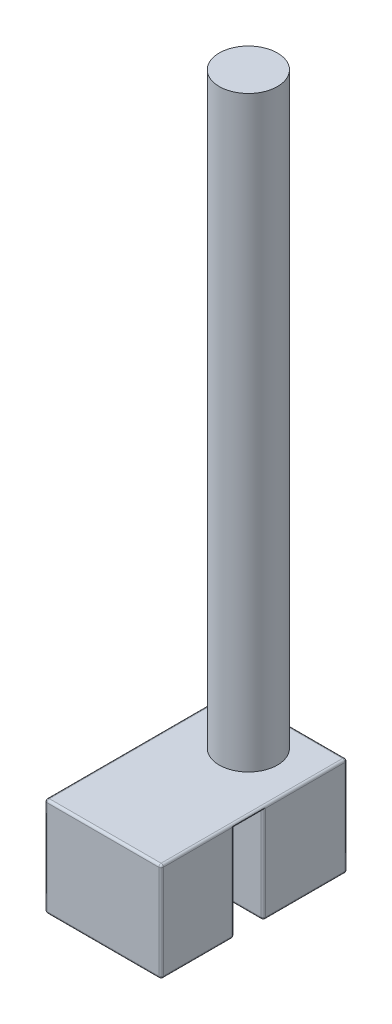
ISO-10303-21;
HEADER;
FILE_DESCRIPTION(('STEP AP214'),'2;1');
FILE_NAME('part.step','',(''),(''),'','','');
FILE_SCHEMA(('AUTOMOTIVE_DESIGN { 1 0 10303 214 1 1 1 1 }'));
ENDSEC;
DATA;
#1=APPLICATION_CONTEXT('core data for automotive mechanical design processes');
#2=APPLICATION_PROTOCOL_DEFINITION('international standard','automotive_design',2000,#1);
#3=PRODUCT_CONTEXT('',#1,'mechanical');
#4=PRODUCT('Part','Part','',(#3));
#5=PRODUCT_RELATED_PRODUCT_CATEGORY('part','',(#4));
#6=PRODUCT_DEFINITION_FORMATION('','',#4);
#7=PRODUCT_DEFINITION_CONTEXT('part definition',#1,'design');
#8=PRODUCT_DEFINITION('design','',#6,#7);
#9=PRODUCT_DEFINITION_SHAPE('','',#8);
#10=(LENGTH_UNIT() NAMED_UNIT(*) SI_UNIT(.MILLI.,.METRE.));
#11=(NAMED_UNIT(*) PLANE_ANGLE_UNIT() SI_UNIT($,.RADIAN.));
#12=(NAMED_UNIT(*) SI_UNIT($,.STERADIAN.) SOLID_ANGLE_UNIT());
#13=UNCERTAINTY_MEASURE_WITH_UNIT(LENGTH_MEASURE(1.E-05),#10,'distance_accuracy_value','');
#14=(GEOMETRIC_REPRESENTATION_CONTEXT(3) GLOBAL_UNCERTAINTY_ASSIGNED_CONTEXT((#13)) GLOBAL_UNIT_ASSIGNED_CONTEXT((#10,
#11,#12)) REPRESENTATION_CONTEXT('',''));
#15=CARTESIAN_POINT('',(0.,0.,0.));
#16=DIRECTION('',(0.,0.,1.));
#17=DIRECTION('',(1.,0.,0.));
#18=AXIS2_PLACEMENT_3D('',#15,#16,#17);
#19=CARTESIAN_POINT('',(39.990340286254,85.,-18.5580204778157));
#20=DIRECTION('',(-1.,0.,0.));
#21=DIRECTION('',(0.,0.,1.));
#22=AXIS2_PLACEMENT_3D('',#19,#20,#21);
#23=PLANE('',#22);
#24=DIRECTION('',(0.,1.,0.));
#25=VECTOR('',#24,1.);
#26=CARTESIAN_POINT('',(39.990340286254,85.,51.6780797430993));
#27=LINE('',#26,#25);
#28=CARTESIAN_POINT('',(39.990340286254,83.,51.6780797430993));
#29=VERTEX_POINT('',#28);
#30=CARTESIAN_POINT('',(39.990340286254,2.,51.6780797430993));
#31=VERTEX_POINT('',#30);
#32=EDGE_CURVE('E227',#29,#31,#27,.F.);
#33=ORIENTED_EDGE('',*,*,#32,.T.);
#34=DIRECTION('',(0.,0.,-1.));
#35=VECTOR('',#34,1.);
#36=CARTESIAN_POINT('',(39.990340286254,2.,-18.5580204778157));
#37=LINE('',#36,#35);
#38=CARTESIAN_POINT('',(39.990340286254,2.,-16.5580204778157));
#39=VERTEX_POINT('',#38);
#40=EDGE_CURVE('E307',#31,#39,#37,.T.);
#41=ORIENTED_EDGE('',*,*,#40,.T.);
#42=DIRECTION('',(0.,-1.,0.));
#43=VECTOR('',#42,1.);
#44=CARTESIAN_POINT('',(39.990340286254,85.,-16.5580204778157));
#45=LINE('',#44,#43);
#46=CARTESIAN_POINT('',(39.990340286254,83.,-16.5580204778157));
#47=VERTEX_POINT('',#46);
#48=EDGE_CURVE('E305',#39,#47,#45,.F.);
#49=ORIENTED_EDGE('',*,*,#48,.T.);
#50=DIRECTION('',(0.,0.,-1.));
#51=VECTOR('',#50,1.);
#52=CARTESIAN_POINT('',(39.990340286254,83.,141.441979522184));
#53=LINE('',#52,#51);
#54=EDGE_CURVE('E303',#47,#29,#53,.F.);
#55=ORIENTED_EDGE('',*,*,#54,.T.);
#56=EDGE_LOOP('',(#33,#41,#49,#55));
#57=FACE_BOUND('',#56,.T.);
#58=ADVANCED_FACE('F35',(#57),#23,.F.);
#59=CARTESIAN_POINT('',(-60.009659713746,85.,-18.5580204778157));
#60=DIRECTION('',(1.,0.,0.));
#61=DIRECTION('',(0.,0.,-1.));
#62=AXIS2_PLACEMENT_3D('',#59,#60,#61);
#63=PLANE('',#62);
#64=DIRECTION('',(0.,0.,1.));
#65=VECTOR('',#64,1.);
#66=CARTESIAN_POINT('',(-60.009659713746,83.,-18.5580204778157));
#67=LINE('',#66,#65);
#68=CARTESIAN_POINT('',(-60.009659713746,83.,139.441979522184));
#69=VERTEX_POINT('',#68);
#70=CARTESIAN_POINT('',(-60.009659713746,83.,-16.5580204778157));
#71=VERTEX_POINT('',#70);
#72=EDGE_CURVE('E288',#69,#71,#67,.F.);
#73=ORIENTED_EDGE('',*,*,#72,.T.);
#74=DIRECTION('',(0.,-1.,0.));
#75=VECTOR('',#74,1.);
#76=CARTESIAN_POINT('',(-60.009659713746,85.,-16.5580204778157));
#77=LINE('',#76,#75);
#78=CARTESIAN_POINT('',(-60.009659713746,2.,-16.5580204778157));
#79=VERTEX_POINT('',#78);
#80=EDGE_CURVE('E294',#71,#79,#77,.T.);
#81=ORIENTED_EDGE('',*,*,#80,.T.);
#82=DIRECTION('',(0.,0.,1.));
#83=VECTOR('',#82,1.);
#84=CARTESIAN_POINT('',(-60.009659713746,2.,-18.5580204778157));
#85=LINE('',#84,#83);
#86=CARTESIAN_POINT('',(-60.009659713746,2.,139.441979522184));
#87=VERTEX_POINT('',#86);
#88=EDGE_CURVE('E292',#79,#87,#85,.T.);
#89=ORIENTED_EDGE('',*,*,#88,.T.);
#90=DIRECTION('',(0.,-1.,0.));
#91=VECTOR('',#90,1.);
#92=CARTESIAN_POINT('',(-60.009659713746,85.,139.441979522184));
#93=LINE('',#92,#91);
#94=EDGE_CURVE('E290',#87,#69,#93,.F.);
#95=ORIENTED_EDGE('',*,*,#94,.T.);
#96=EDGE_LOOP('',(#73,#81,#89,#95));
#97=FACE_BOUND('',#96,.T.);
#98=ADVANCED_FACE('F539',(#97),#63,.F.);
#99=CARTESIAN_POINT('',(-60.009659713746,85.,141.441979522184));
#100=DIRECTION('',(0.,0.,-1.));
#101=DIRECTION('',(-1.,0.,0.));
#102=AXIS2_PLACEMENT_3D('',#99,#100,#101);
#103=PLANE('',#102);
#104=DIRECTION('',(0.,-1.,0.));
#105=VECTOR('',#104,1.);
#106=CARTESIAN_POINT('',(37.990340286254,85.,141.441979522184));
#107=LINE('',#106,#105);
#108=CARTESIAN_POINT('',(37.990340286254,2.,141.441979522184));
#109=VERTEX_POINT('',#108);
#110=CARTESIAN_POINT('',(37.990340286254,83.,141.441979522184));
#111=VERTEX_POINT('',#110);
#112=EDGE_CURVE('E52',#109,#111,#107,.F.);
#113=ORIENTED_EDGE('',*,*,#112,.T.);
#114=DIRECTION('',(1.,0.,0.));
#115=VECTOR('',#114,1.);
#116=CARTESIAN_POINT('',(-60.009659713746,83.,141.441979522184));
#117=LINE('',#116,#115);
#118=CARTESIAN_POINT('',(-58.009659713746,83.,141.441979522184));
#119=VERTEX_POINT('',#118);
#120=EDGE_CURVE('E315',#111,#119,#117,.F.);
#121=ORIENTED_EDGE('',*,*,#120,.T.);
#122=DIRECTION('',(0.,-1.,0.));
#123=VECTOR('',#122,1.);
#124=CARTESIAN_POINT('',(-58.009659713746,85.,141.441979522184));
#125=LINE('',#124,#123);
#126=CARTESIAN_POINT('',(-58.009659713746,2.,141.441979522184));
#127=VERTEX_POINT('',#126);
#128=EDGE_CURVE('E311',#119,#127,#125,.T.);
#129=ORIENTED_EDGE('',*,*,#128,.T.);
#130=DIRECTION('',(1.,0.,0.));
#131=VECTOR('',#130,1.);
#132=CARTESIAN_POINT('',(-60.009659713746,2.,141.441979522184));
#133=LINE('',#132,#131);
#134=EDGE_CURVE('E57',#127,#109,#133,.T.);
#135=ORIENTED_EDGE('',*,*,#134,.T.);
#136=EDGE_LOOP('',(#113,#121,#129,#135));
#137=FACE_BOUND('',#136,.T.);
#138=ADVANCED_FACE('F513',(#137),#103,.F.);
#139=DIRECTION('',(0.,-1.,0.));
#140=VECTOR('',#139,1.);
#141=CARTESIAN_POINT('',(39.990340286254,85.,139.441979522184));
#142=LINE('',#141,#140);
#143=CARTESIAN_POINT('',(39.990340286254,83.,139.441979522184));
#144=VERTEX_POINT('',#143);
#145=CARTESIAN_POINT('',(39.990340286254,2.,139.441979522184));
#146=VERTEX_POINT('',#145);
#147=EDGE_CURVE('E297',#144,#146,#142,.T.);
#148=ORIENTED_EDGE('',*,*,#147,.T.);
#149=DIRECTION('',(0.,0.,-1.));
#150=VECTOR('',#149,1.);
#151=CARTESIAN_POINT('',(39.990340286254,2.,-18.5580204778157));
#152=LINE('',#151,#150);
#153=CARTESIAN_POINT('',(39.990340286254,2.,80.6780797430993));
#154=VERTEX_POINT('',#153);
#155=EDGE_CURVE('E301',#146,#154,#152,.T.);
#156=ORIENTED_EDGE('',*,*,#155,.T.);
#157=DIRECTION('',(0.,-1.,0.));
#158=VECTOR('',#157,1.);
#159=CARTESIAN_POINT('',(39.990340286254,85.,80.6780797430993));
#160=LINE('',#159,#158);
#161=CARTESIAN_POINT('',(39.990340286254,83.,80.6780797430993));
#162=VERTEX_POINT('',#161);
#163=EDGE_CURVE('E209',#154,#162,#160,.F.);
#164=ORIENTED_EDGE('',*,*,#163,.T.);
#165=DIRECTION('',(0.,0.,-1.));
#166=VECTOR('',#165,1.);
#167=CARTESIAN_POINT('',(39.990340286254,83.,141.441979522184));
#168=LINE('',#167,#166);
#169=EDGE_CURVE('E299',#162,#144,#168,.F.);
#170=ORIENTED_EDGE('',*,*,#169,.T.);
#171=EDGE_LOOP('',(#148,#156,#164,#170));
#172=FACE_BOUND('',#171,.T.);
#173=ADVANCED_FACE('F427',(#172),#23,.F.);
#174=CARTESIAN_POINT('',(-60.009659713746,85.,-18.5580204778157));
#175=DIRECTION('',(0.,0.,1.));
#176=DIRECTION('',(1.,0.,0.));
#177=AXIS2_PLACEMENT_3D('',#174,#175,#176);
#178=PLANE('',#177);
#179=DIRECTION('',(0.,-1.,0.));
#180=VECTOR('',#179,1.);
#181=CARTESIAN_POINT('',(-58.009659713746,85.,-18.5580204778157));
#182=LINE('',#181,#180);
#183=CARTESIAN_POINT('',(-58.009659713746,2.,-18.5580204778157));
#184=VERTEX_POINT('',#183);
#185=CARTESIAN_POINT('',(-58.009659713746,83.,-18.5580204778157));
#186=VERTEX_POINT('',#185);
#187=EDGE_CURVE('E283',#184,#186,#182,.F.);
#188=ORIENTED_EDGE('',*,*,#187,.T.);
#189=DIRECTION('',(-1.,0.,0.));
#190=VECTOR('',#189,1.);
#191=CARTESIAN_POINT('',(39.990340286254,83.,-18.5580204778157));
#192=LINE('',#191,#190);
#193=CARTESIAN_POINT('',(37.990340286254,83.,-18.5580204778157));
#194=VERTEX_POINT('',#193);
#195=EDGE_CURVE('E285',#186,#194,#192,.F.);
#196=ORIENTED_EDGE('',*,*,#195,.T.);
#197=DIRECTION('',(0.,-1.,0.));
#198=VECTOR('',#197,1.);
#199=CARTESIAN_POINT('',(37.990340286254,85.,-18.5580204778157));
#200=LINE('',#199,#198);
#201=CARTESIAN_POINT('',(37.990340286254,2.,-18.5580204778157));
#202=VERTEX_POINT('',#201);
#203=EDGE_CURVE('E279',#194,#202,#200,.T.);
#204=ORIENTED_EDGE('',*,*,#203,.T.);
#205=DIRECTION('',(-1.,0.,0.));
#206=VECTOR('',#205,1.);
#207=CARTESIAN_POINT('',(-60.009659713746,2.,-18.5580204778157));
#208=LINE('',#207,#206);
#209=EDGE_CURVE('E281',#202,#184,#208,.T.);
#210=ORIENTED_EDGE('',*,*,#209,.T.);
#211=EDGE_LOOP('',(#188,#196,#204,#210));
#212=FACE_BOUND('',#211,.T.);
#213=ADVANCED_FACE('F489',(#212),#178,.F.);
#214=CARTESIAN_POINT('',(0.,85.,0.));
#215=DIRECTION('',(0.,1.,0.));
#216=DIRECTION('',(0.,0.,1.));
#217=AXIS2_PLACEMENT_3D('',#214,#215,#216);
#218=PLANE('',#217);
#219=DIRECTION('',(0.,0.,-1.));
#220=VECTOR('',#219,1.);
#221=CARTESIAN_POINT('',(37.990340286254,85.,-18.5580204778157));
#222=LINE('',#221,#220);
#223=CARTESIAN_POINT('',(37.990340286254,85.,139.441979522184));
#224=VERTEX_POINT('',#223);
#225=CARTESIAN_POINT('',(37.990340286254,85.,-16.5580204778157));
#226=VERTEX_POINT('',#225);
#227=EDGE_CURVE('E274',#224,#226,#222,.T.);
#228=ORIENTED_EDGE('',*,*,#227,.T.);
#229=DIRECTION('',(-1.,0.,0.));
#230=VECTOR('',#229,1.);
#231=CARTESIAN_POINT('',(-60.009659713746,85.,-16.5580204778157));
#232=LINE('',#231,#230);
#233=CARTESIAN_POINT('',(-58.009659713746,85.,-16.5580204778157));
#234=VERTEX_POINT('',#233);
#235=EDGE_CURVE('E276',#226,#234,#232,.T.);
#236=ORIENTED_EDGE('',*,*,#235,.T.);
#237=DIRECTION('',(0.,0.,1.));
#238=VECTOR('',#237,1.);
#239=CARTESIAN_POINT('',(-58.009659713746,85.,141.441979522184));
#240=LINE('',#239,#238);
#241=CARTESIAN_POINT('',(-58.009659713746,85.,139.441979522184));
#242=VERTEX_POINT('',#241);
#243=EDGE_CURVE('E270',#234,#242,#240,.T.);
#244=ORIENTED_EDGE('',*,*,#243,.T.);
#245=DIRECTION('',(1.,0.,0.));
#246=VECTOR('',#245,1.);
#247=CARTESIAN_POINT('',(39.990340286254,85.,139.441979522184));
#248=LINE('',#247,#246);
#249=EDGE_CURVE('E272',#242,#224,#248,.T.);
#250=ORIENTED_EDGE('',*,*,#249,.T.);
#251=EDGE_LOOP('',(#228,#236,#244,#250));
#252=FACE_BOUND('',#251,.T.);
#253=CARTESIAN_POINT('',(-10.009659713746,85.,16.4419795221843));
#254=DIRECTION('',(0.,1.,0.));
#255=DIRECTION('',(0.,0.,1.));
#256=AXIS2_PLACEMENT_3D('',#253,#254,#255);
#257=CIRCLE('',#256,25.);
#258=CARTESIAN_POINT('',(-10.009659713746,85.,41.4419795221843));
#259=VERTEX_POINT('',#258);
#260=EDGE_CURVE('E210',#259,#259,#257,.F.);
#261=ORIENTED_EDGE('',*,*,#260,.T.);
#262=EDGE_LOOP('',(#261));
#263=FACE_BOUND('',#262,.T.);
#264=ADVANCED_FACE('F508',(#252,#263),#218,.T.);
#265=CARTESIAN_POINT('',(0.,0.,0.));
#266=DIRECTION('',(0.,1.,0.));
#267=DIRECTION('',(0.,0.,1.));
#268=AXIS2_PLACEMENT_3D('',#265,#266,#267);
#269=PLANE('',#268);
#270=DIRECTION('',(1.,0.,0.));
#271=VECTOR('',#270,1.);
#272=CARTESIAN_POINT('',(0.,0.,51.6780797430993));
#273=LINE('',#272,#271);
#274=CARTESIAN_POINT('',(37.990340286254,0.,51.6780797430993));
#275=VERTEX_POINT('',#274);
#276=CARTESIAN_POINT('',(-30.009659713746,0.,51.6780797430993));
#277=VERTEX_POINT('',#276);
#278=EDGE_CURVE('E258',#275,#277,#273,.F.);
#279=ORIENTED_EDGE('',*,*,#278,.T.);
#280=DIRECTION('',(0.,0.,-1.));
#281=VECTOR('',#280,1.);
#282=CARTESIAN_POINT('',(-30.009659713746,0.,78.6780797430993));
#283=LINE('',#282,#281);
#284=CARTESIAN_POINT('',(-30.009659713746,0.,80.6780797430993));
#285=VERTEX_POINT('',#284);
#286=EDGE_CURVE('E221',#285,#277,#283,.T.);
#287=ORIENTED_EDGE('',*,*,#286,.F.);
#288=DIRECTION('',(1.,0.,0.));
#289=VECTOR('',#288,1.);
#290=CARTESIAN_POINT('',(0.,0.,80.6780797430993));
#291=LINE('',#290,#289);
#292=CARTESIAN_POINT('',(37.990340286254,0.,80.6780797430993));
#293=VERTEX_POINT('',#292);
#294=EDGE_CURVE('E254',#285,#293,#291,.T.);
#295=ORIENTED_EDGE('',*,*,#294,.T.);
#296=DIRECTION('',(0.,0.,-1.));
#297=VECTOR('',#296,1.);
#298=CARTESIAN_POINT('',(37.990340286254,0.,0.));
#299=LINE('',#298,#297);
#300=CARTESIAN_POINT('',(37.990340286254,0.,139.441979522184));
#301=VERTEX_POINT('',#300);
#302=EDGE_CURVE('E250',#293,#301,#299,.F.);
#303=ORIENTED_EDGE('',*,*,#302,.T.);
#304=DIRECTION('',(1.,0.,0.));
#305=VECTOR('',#304,1.);
#306=CARTESIAN_POINT('',(0.,0.,139.441979522184));
#307=LINE('',#306,#305);
#308=CARTESIAN_POINT('',(-58.009659713746,0.,139.441979522184));
#309=VERTEX_POINT('',#308);
#310=EDGE_CURVE('E248',#301,#309,#307,.F.);
#311=ORIENTED_EDGE('',*,*,#310,.T.);
#312=DIRECTION('',(0.,0.,1.));
#313=VECTOR('',#312,1.);
#314=CARTESIAN_POINT('',(-58.009659713746,0.,0.));
#315=LINE('',#314,#313);
#316=CARTESIAN_POINT('',(-58.009659713746,0.,-16.5580204778157));
#317=VERTEX_POINT('',#316);
#318=EDGE_CURVE('E246',#309,#317,#315,.F.);
#319=ORIENTED_EDGE('',*,*,#318,.T.);
#320=DIRECTION('',(-1.,0.,0.));
#321=VECTOR('',#320,1.);
#322=CARTESIAN_POINT('',(0.,0.,-16.5580204778157));
#323=LINE('',#322,#321);
#324=CARTESIAN_POINT('',(37.990340286254,0.,-16.5580204778157));
#325=VERTEX_POINT('',#324);
#326=EDGE_CURVE('E252',#317,#325,#323,.F.);
#327=ORIENTED_EDGE('',*,*,#326,.T.);
#328=DIRECTION('',(0.,0.,-1.));
#329=VECTOR('',#328,1.);
#330=CARTESIAN_POINT('',(37.990340286254,0.,0.));
#331=LINE('',#330,#329);
#332=EDGE_CURVE('E256',#325,#275,#331,.F.);
#333=ORIENTED_EDGE('',*,*,#332,.T.);
#334=EDGE_LOOP('',(#279,#287,#295,#303,#311,#319,#327,#333));
#335=FACE_BOUND('',#334,.T.);
#336=ADVANCED_FACE('F454',(#335),#269,.F.);
#337=CARTESIAN_POINT('',(-10.009659713746,590.,16.4419795221843));
#338=DIRECTION('',(0.,-1.,0.));
#339=DIRECTION('',(0.,0.,-1.));
#340=AXIS2_PLACEMENT_3D('',#337,#338,#339);
#341=CYLINDRICAL_SURFACE('',#340,25.);
#342=ORIENTED_EDGE('',*,*,#260,.F.);
#343=EDGE_LOOP('',(#342));
#344=FACE_BOUND('',#343,.T.);
#345=CARTESIAN_POINT('',(-10.009659713746,590.,16.4419795221843));
#346=DIRECTION('',(0.,1.,0.));
#347=DIRECTION('',(0.,0.,1.));
#348=AXIS2_PLACEMENT_3D('',#345,#346,#347);
#349=CIRCLE('',#348,25.);
#350=CARTESIAN_POINT('',(-10.009659713746,590.,41.4419795221843));
#351=VERTEX_POINT('',#350);
#352=EDGE_CURVE('E418',#351,#351,#349,.T.);
#353=ORIENTED_EDGE('',*,*,#352,.F.);
#354=EDGE_LOOP('',(#353));
#355=FACE_BOUND('',#354,.T.);
#356=ADVANCED_FACE('F801',(#344,#355),#341,.T.);
#357=CARTESIAN_POINT('',(-10.009659713746,590.,16.4419795221843));
#358=DIRECTION('',(0.,1.,0.));
#359=DIRECTION('',(0.,0.,1.));
#360=AXIS2_PLACEMENT_3D('',#357,#358,#359);
#361=PLANE('',#360);
#362=ORIENTED_EDGE('',*,*,#352,.T.);
#363=EDGE_LOOP('',(#362));
#364=FACE_BOUND('',#363,.T.);
#365=ADVANCED_FACE('F794',(#364),#361,.T.);
#366=CARTESIAN_POINT('',(-30.009659713746,82.,53.6780797430993));
#367=DIRECTION('',(0.,0.,-1.));
#368=DIRECTION('',(0.,1.,0.));
#369=AXIS2_PLACEMENT_3D('',#366,#367,#368);
#370=PLANE('',#369);
#371=DIRECTION('',(0.,1.,0.));
#372=VECTOR('',#371,1.);
#373=CARTESIAN_POINT('',(-30.009659713746,82.,53.6780797430993));
#374=LINE('',#373,#372);
#375=CARTESIAN_POINT('',(-30.009659713746,2.,53.6780797430993));
#376=VERTEX_POINT('',#375);
#377=CARTESIAN_POINT('',(-30.009659713746,77.,53.6780797430993));
#378=VERTEX_POINT('',#377);
#379=EDGE_CURVE('E237',#376,#378,#374,.T.);
#380=ORIENTED_EDGE('',*,*,#379,.F.);
#381=DIRECTION('',(1.,0.,0.));
#382=VECTOR('',#381,1.);
#383=CARTESIAN_POINT('',(-30.009659713746,2.,53.6780797430993));
#384=LINE('',#383,#382);
#385=CARTESIAN_POINT('',(37.990340286254,2.,53.6780797430993));
#386=VERTEX_POINT('',#385);
#387=EDGE_CURVE('E208',#376,#386,#384,.T.);
#388=ORIENTED_EDGE('',*,*,#387,.T.);
#389=DIRECTION('',(0.,1.,0.));
#390=VECTOR('',#389,1.);
#391=CARTESIAN_POINT('',(37.990340286254,82.,53.6780797430993));
#392=LINE('',#391,#390);
#393=CARTESIAN_POINT('',(37.990340286254,82.,53.6780797430993));
#394=VERTEX_POINT('',#393);
#395=EDGE_CURVE('E189',#386,#394,#392,.T.);
#396=ORIENTED_EDGE('',*,*,#395,.T.);
#397=DIRECTION('',(1.,0.,0.));
#398=VECTOR('',#397,1.);
#399=CARTESIAN_POINT('',(-30.009659713746,82.,53.6780797430993));
#400=LINE('',#399,#398);
#401=CARTESIAN_POINT('',(-25.009659713746,82.,53.6780797430993));
#402=VERTEX_POINT('',#401);
#403=EDGE_CURVE('E205',#402,#394,#400,.T.);
#404=ORIENTED_EDGE('',*,*,#403,.F.);
#405=CARTESIAN_POINT('',(-25.009659713746,77.,53.6780797430993));
#406=DIRECTION('',(0.,0.,-1.));
#407=DIRECTION('',(0.,1.,0.));
#408=AXIS2_PLACEMENT_3D('',#405,#406,#407);
#409=CIRCLE('',#408,5.);
#410=EDGE_CURVE('E243',#402,#378,#409,.F.);
#411=ORIENTED_EDGE('',*,*,#410,.T.);
#412=EDGE_LOOP('',(#380,#388,#396,#404,#411));
#413=FACE_BOUND('',#412,.T.);
#414=ADVANCED_FACE('F203',(#413),#370,.F.);
#415=CARTESIAN_POINT('',(-30.009659713746,82.,78.6780797430993));
#416=DIRECTION('',(0.,0.,1.));
#417=DIRECTION('',(0.,-1.,0.));
#418=AXIS2_PLACEMENT_3D('',#415,#416,#417);
#419=PLANE('',#418);
#420=DIRECTION('',(0.,-1.,0.));
#421=VECTOR('',#420,1.);
#422=CARTESIAN_POINT('',(37.990340286254,82.,78.6780797430993));
#423=LINE('',#422,#421);
#424=CARTESIAN_POINT('',(37.990340286254,82.,78.6780797430993));
#425=VERTEX_POINT('',#424);
#426=CARTESIAN_POINT('',(37.990340286254,2.,78.6780797430993));
#427=VERTEX_POINT('',#426);
#428=EDGE_CURVE('E226',#425,#427,#423,.T.);
#429=ORIENTED_EDGE('',*,*,#428,.T.);
#430=DIRECTION('',(1.,0.,0.));
#431=VECTOR('',#430,1.);
#432=CARTESIAN_POINT('',(-30.009659713746,2.,78.6780797430993));
#433=LINE('',#432,#431);
#434=CARTESIAN_POINT('',(-30.009659713746,2.,78.6780797430993));
#435=VERTEX_POINT('',#434);
#436=EDGE_CURVE('E264',#427,#435,#433,.F.);
#437=ORIENTED_EDGE('',*,*,#436,.T.);
#438=DIRECTION('',(0.,-1.,0.));
#439=VECTOR('',#438,1.);
#440=CARTESIAN_POINT('',(-30.009659713746,82.,78.6780797430993));
#441=LINE('',#440,#439);
#442=CARTESIAN_POINT('',(-30.009659713746,77.,78.6780797430993));
#443=VERTEX_POINT('',#442);
#444=EDGE_CURVE('E410',#443,#435,#441,.T.);
#445=ORIENTED_EDGE('',*,*,#444,.F.);
#446=CARTESIAN_POINT('',(-25.009659713746,77.,78.6780797430993));
#447=DIRECTION('',(0.,0.,1.));
#448=DIRECTION('',(0.,-1.,0.));
#449=AXIS2_PLACEMENT_3D('',#446,#447,#448);
#450=CIRCLE('',#449,5.);
#451=CARTESIAN_POINT('',(-25.009659713746,82.,78.6780797430993));
#452=VERTEX_POINT('',#451);
#453=EDGE_CURVE('E240',#443,#452,#450,.F.);
#454=ORIENTED_EDGE('',*,*,#453,.T.);
#455=DIRECTION('',(1.,0.,0.));
#456=VECTOR('',#455,1.);
#457=CARTESIAN_POINT('',(-30.009659713746,82.,78.6780797430993));
#458=LINE('',#457,#456);
#459=EDGE_CURVE('E220',#452,#425,#458,.T.);
#460=ORIENTED_EDGE('',*,*,#459,.T.);
#461=EDGE_LOOP('',(#429,#437,#445,#454,#460));
#462=FACE_BOUND('',#461,.T.);
#463=ADVANCED_FACE('F409',(#462),#419,.F.);
#464=CARTESIAN_POINT('',(-30.009659713746,82.,78.6780797430993));
#465=DIRECTION('',(0.,1.,0.));
#466=DIRECTION('',(0.,0.,1.));
#467=AXIS2_PLACEMENT_3D('',#464,#465,#466);
#468=PLANE('',#467);
#469=ORIENTED_EDGE('',*,*,#459,.F.);
#470=DIRECTION('',(0.,0.,1.));
#471=VECTOR('',#470,1.);
#472=CARTESIAN_POINT('',(-25.009659713746,82.,78.6780797430993));
#473=LINE('',#472,#471);
#474=EDGE_CURVE('E219',#452,#402,#473,.F.);
#475=ORIENTED_EDGE('',*,*,#474,.T.);
#476=ORIENTED_EDGE('',*,*,#403,.T.);
#477=DIRECTION('',(0.,0.,1.));
#478=VECTOR('',#477,1.);
#479=CARTESIAN_POINT('',(37.990340286254,82.,78.6780797430993));
#480=LINE('',#479,#478);
#481=EDGE_CURVE('E216',#394,#425,#480,.T.);
#482=ORIENTED_EDGE('',*,*,#481,.T.);
#483=EDGE_LOOP('',(#469,#475,#476,#482));
#484=FACE_BOUND('',#483,.T.);
#485=ADVANCED_FACE('F215',(#484),#468,.F.);
#486=CARTESIAN_POINT('',(-30.009659713746,0.,0.));
#487=DIRECTION('',(1.,0.,0.));
#488=DIRECTION('',(0.,0.,-1.));
#489=AXIS2_PLACEMENT_3D('',#486,#487,#488);
#490=PLANE('',#489);
#491=ORIENTED_EDGE('',*,*,#286,.T.);
#492=CARTESIAN_POINT('',(-30.009659713746,2.,51.6780797430993));
#493=DIRECTION('',(1.,0.,0.));
#494=DIRECTION('',(0.,0.,-1.));
#495=AXIS2_PLACEMENT_3D('',#492,#493,#494);
#496=CIRCLE('',#495,2.);
#497=EDGE_CURVE('E44',#277,#376,#496,.F.);
#498=ORIENTED_EDGE('',*,*,#497,.T.);
#499=ORIENTED_EDGE('',*,*,#379,.T.);
#500=DIRECTION('',(0.,0.,1.));
#501=VECTOR('',#500,1.);
#502=CARTESIAN_POINT('',(-30.009659713746,77.,0.));
#503=LINE('',#502,#501);
#504=EDGE_CURVE('E230',#378,#443,#503,.T.);
#505=ORIENTED_EDGE('',*,*,#504,.T.);
#506=ORIENTED_EDGE('',*,*,#444,.T.);
#507=CARTESIAN_POINT('',(-30.009659713746,2.,80.6780797430993));
#508=DIRECTION('',(1.,0.,0.));
#509=DIRECTION('',(0.,0.,-1.));
#510=AXIS2_PLACEMENT_3D('',#507,#508,#509);
#511=CIRCLE('',#510,2.);
#512=EDGE_CURVE('E11',#435,#285,#511,.F.);
#513=ORIENTED_EDGE('',*,*,#512,.T.);
#514=EDGE_LOOP('',(#491,#498,#499,#505,#506,#513));
#515=FACE_BOUND('',#514,.T.);
#516=ADVANCED_FACE('F412',(#515),#490,.T.);
#517=CARTESIAN_POINT('',(37.990340286254,82.,80.6780797430993));
#518=DIRECTION('',(0.,-1.,0.));
#519=DIRECTION('',(0.,0.,-1.));
#520=AXIS2_PLACEMENT_3D('',#517,#518,#519);
#521=CYLINDRICAL_SURFACE('',#520,2.);
#522=ORIENTED_EDGE('',*,*,#163,.F.);
#523=CARTESIAN_POINT('',(37.990340286254,2.,80.6780797430993));
#524=DIRECTION('',(0.,-1.,0.));
#525=DIRECTION('',(0.,0.,-1.));
#526=AXIS2_PLACEMENT_3D('',#523,#524,#525);
#527=CIRCLE('',#526,2.);
#528=EDGE_CURVE('E268',#154,#427,#527,.F.);
#529=ORIENTED_EDGE('',*,*,#528,.T.);
#530=ORIENTED_EDGE('',*,*,#428,.F.);
#531=CARTESIAN_POINT('',(37.990340286254,84.,80.6780797430993));
#532=DIRECTION('',(0.,-0.707106781186548,0.707106781186547));
#533=DIRECTION('',(0.,0.707106781186547,0.707106781186548));
#534=AXIS2_PLACEMENT_3D('',#531,#532,#533);
#535=ELLIPSE('',#534,2.82842712474619,2.);
#536=CARTESIAN_POINT('',(39.9268319593577,83.5,80.1780797430993));
#537=VERTEX_POINT('',#536);
#538=EDGE_CURVE('E196',#537,#425,#535,.F.);
#539=ORIENTED_EDGE('',*,*,#538,.F.);
#540=CARTESIAN_POINT('',(37.990340286254,83.,80.6780797430993));
#541=DIRECTION('',(0.,-0.707106781186547,-0.707106781186548));
#542=DIRECTION('',(0.,-0.707106781186548,0.707106781186547));
#543=AXIS2_PLACEMENT_3D('',#540,#541,#542);
#544=ELLIPSE('',#543,2.82842712474619,2.);
#545=EDGE_CURVE('E266',#537,#162,#544,.T.);
#546=ORIENTED_EDGE('',*,*,#545,.T.);
#547=EDGE_LOOP('',(#522,#529,#530,#539,#546));
#548=FACE_BOUND('',#547,.T.);
#549=ADVANCED_FACE('F562',(#548),#521,.T.);
#550=CARTESIAN_POINT('',(37.990340286254,84.,78.6780797430993));
#551=DIRECTION('',(0.,0.,1.));
#552=DIRECTION('',(1.,0.,0.));
#553=AXIS2_PLACEMENT_3D('',#550,#551,#552);
#554=CYLINDRICAL_SURFACE('',#553,2.);
#555=CARTESIAN_POINT('',(37.990340286254,84.,51.6780797430993));
#556=DIRECTION('',(0.,0.707106781186547,0.707106781186548));
#557=DIRECTION('',(0.,0.707106781186548,-0.707106781186547));
#558=AXIS2_PLACEMENT_3D('',#555,#556,#557);
#559=ELLIPSE('',#558,2.82842712474619,2.);
#560=CARTESIAN_POINT('',(39.9268319593577,83.5,52.1780797430993));
#561=VERTEX_POINT('',#560);
#562=EDGE_CURVE('E186',#561,#394,#559,.F.);
#563=ORIENTED_EDGE('',*,*,#562,.F.);
#564=DIRECTION('',(0.,0.,1.));
#565=VECTOR('',#564,1.);
#566=CARTESIAN_POINT('',(39.9268319593577,83.5,52.1780797430993));
#567=LINE('',#566,#565);
#568=EDGE_CURVE('E309',#561,#537,#567,.T.);
#569=ORIENTED_EDGE('',*,*,#568,.T.);
#570=ORIENTED_EDGE('',*,*,#538,.T.);
#571=ORIENTED_EDGE('',*,*,#481,.F.);
#572=EDGE_LOOP('',(#563,#569,#570,#571));
#573=FACE_BOUND('',#572,.T.);
#574=ADVANCED_FACE('F223',(#573),#554,.T.);
#575=CARTESIAN_POINT('',(37.990340286254,82.,51.6780797430993));
#576=DIRECTION('',(0.,1.,0.));
#577=DIRECTION('',(0.,0.,1.));
#578=AXIS2_PLACEMENT_3D('',#575,#576,#577);
#579=CYLINDRICAL_SURFACE('',#578,2.);
#580=ORIENTED_EDGE('',*,*,#395,.F.);
#581=CARTESIAN_POINT('',(37.990340286254,2.,51.6780797430993));
#582=DIRECTION('',(0.,1.,0.));
#583=DIRECTION('',(0.,0.,1.));
#584=AXIS2_PLACEMENT_3D('',#581,#582,#583);
#585=CIRCLE('',#584,2.);
#586=EDGE_CURVE('E262',#386,#31,#585,.T.);
#587=ORIENTED_EDGE('',*,*,#586,.T.);
#588=ORIENTED_EDGE('',*,*,#32,.F.);
#589=CARTESIAN_POINT('',(37.990340286254,83.,51.6780797430993));
#590=DIRECTION('',(0.,0.707106781186548,-0.707106781186547));
#591=DIRECTION('',(0.,0.707106781186547,0.707106781186548));
#592=AXIS2_PLACEMENT_3D('',#589,#590,#591);
#593=ELLIPSE('',#592,2.82842712474619,2.);
#594=EDGE_CURVE('E192',#29,#561,#593,.F.);
#595=ORIENTED_EDGE('',*,*,#594,.T.);
#596=ORIENTED_EDGE('',*,*,#562,.T.);
#597=EDGE_LOOP('',(#580,#587,#588,#595,#596));
#598=FACE_BOUND('',#597,.T.);
#599=ADVANCED_FACE('F188',(#598),#579,.T.);
#600=CARTESIAN_POINT('',(-25.009659713746,77.,0.));
#601=DIRECTION('',(0.,0.,1.));
#602=DIRECTION('',(1.,0.,0.));
#603=AXIS2_PLACEMENT_3D('',#600,#601,#602);
#604=CYLINDRICAL_SURFACE('',#603,5.);
#605=ORIENTED_EDGE('',*,*,#410,.F.);
#606=ORIENTED_EDGE('',*,*,#474,.F.);
#607=ORIENTED_EDGE('',*,*,#453,.F.);
#608=ORIENTED_EDGE('',*,*,#504,.F.);
#609=EDGE_LOOP('',(#605,#606,#607,#608));
#610=FACE_BOUND('',#609,.T.);
#611=ADVANCED_FACE('F559',(#610),#604,.F.);
#612=CARTESIAN_POINT('',(0.,2.,80.6780797430993));
#613=DIRECTION('',(1.,0.,0.));
#614=DIRECTION('',(0.,0.,-1.));
#615=AXIS2_PLACEMENT_3D('',#612,#613,#614);
#616=CYLINDRICAL_SURFACE('',#615,2.);
#617=ORIENTED_EDGE('',*,*,#512,.F.);
#618=ORIENTED_EDGE('',*,*,#436,.F.);
#619=CARTESIAN_POINT('',(37.990340286254,2.,80.6780797430993));
#620=DIRECTION('',(1.,0.,0.));
#621=DIRECTION('',(0.,0.,-1.));
#622=AXIS2_PLACEMENT_3D('',#619,#620,#621);
#623=CIRCLE('',#622,2.);
#624=EDGE_CURVE('E39',#293,#427,#623,.T.);
#625=ORIENTED_EDGE('',*,*,#624,.F.);
#626=ORIENTED_EDGE('',*,*,#294,.F.);
#627=EDGE_LOOP('',(#617,#618,#625,#626));
#628=FACE_BOUND('',#627,.T.);
#629=ADVANCED_FACE('F37',(#628),#616,.T.);
#630=CARTESIAN_POINT('',(37.990340286254,2.,80.6780797430993));
#631=DIRECTION('',(0.,1.,0.));
#632=DIRECTION('',(0.,0.,1.));
#633=AXIS2_PLACEMENT_3D('',#630,#631,#632);
#634=SPHERICAL_SURFACE('',#633,2.);
#635=ORIENTED_EDGE('',*,*,#624,.T.);
#636=ORIENTED_EDGE('',*,*,#528,.F.);
#637=CARTESIAN_POINT('',(37.990340286254,2.,80.6780797430993));
#638=DIRECTION('',(0.,0.,1.));
#639=DIRECTION('',(1.,0.,0.));
#640=AXIS2_PLACEMENT_3D('',#637,#638,#639);
#641=CIRCLE('',#640,2.);
#642=EDGE_CURVE('E391',#293,#154,#641,.T.);
#643=ORIENTED_EDGE('',*,*,#642,.F.);
#644=EDGE_LOOP('',(#635,#636,#643));
#645=FACE_BOUND('',#644,.T.);
#646=ADVANCED_FACE('F401',(#645),#634,.T.);
#647=CARTESIAN_POINT('',(-58.009659713746,83.,139.441979522184));
#648=DIRECTION('',(0.,1.,0.));
#649=DIRECTION('',(0.,0.,1.));
#650=AXIS2_PLACEMENT_3D('',#647,#648,#649);
#651=SPHERICAL_SURFACE('',#650,2.);
#652=CARTESIAN_POINT('',(-58.009659713746,83.,139.441979522184));
#653=DIRECTION('',(0.,1.,0.));
#654=DIRECTION('',(0.,0.,1.));
#655=AXIS2_PLACEMENT_3D('',#652,#653,#654);
#656=CIRCLE('',#655,2.);
#657=EDGE_CURVE('E377',#119,#69,#656,.F.);
#658=ORIENTED_EDGE('',*,*,#657,.F.);
#659=CARTESIAN_POINT('',(-58.009659713746,83.,139.441979522184));
#660=DIRECTION('',(-1.,0.,0.));
#661=DIRECTION('',(0.,0.,1.));
#662=AXIS2_PLACEMENT_3D('',#659,#660,#661);
#663=CIRCLE('',#662,2.);
#664=EDGE_CURVE('E383',#242,#119,#663,.F.);
#665=ORIENTED_EDGE('',*,*,#664,.F.);
#666=CARTESIAN_POINT('',(-58.009659713746,83.,139.441979522184));
#667=DIRECTION('',(0.,0.,1.));
#668=DIRECTION('',(1.,0.,0.));
#669=AXIS2_PLACEMENT_3D('',#666,#667,#668);
#670=CIRCLE('',#669,2.);
#671=EDGE_CURVE('E380',#69,#242,#670,.F.);
#672=ORIENTED_EDGE('',*,*,#671,.F.);
#673=EDGE_LOOP('',(#658,#665,#672));
#674=FACE_BOUND('',#673,.T.);
#675=ADVANCED_FACE('F720',(#674),#651,.T.);
#676=CARTESIAN_POINT('',(37.990340286254,2.,-18.5580204778157));
#677=DIRECTION('',(0.,0.,-1.));
#678=DIRECTION('',(-1.,0.,0.));
#679=AXIS2_PLACEMENT_3D('',#676,#677,#678);
#680=CYLINDRICAL_SURFACE('',#679,2.);
#681=CARTESIAN_POINT('',(37.990340286254,2.,139.441979522184));
#682=DIRECTION('',(0.,0.,1.));
#683=DIRECTION('',(1.,0.,0.));
#684=AXIS2_PLACEMENT_3D('',#681,#682,#683);
#685=CIRCLE('',#684,2.);
#686=EDGE_CURVE('E389',#301,#146,#685,.T.);
#687=ORIENTED_EDGE('',*,*,#686,.F.);
#688=ORIENTED_EDGE('',*,*,#302,.F.);
#689=ORIENTED_EDGE('',*,*,#642,.T.);
#690=ORIENTED_EDGE('',*,*,#155,.F.);
#691=EDGE_LOOP('',(#687,#688,#689,#690));
#692=FACE_BOUND('',#691,.T.);
#693=ADVANCED_FACE('F444',(#692),#680,.T.);
#694=CARTESIAN_POINT('',(37.990340286254,2.,139.441979522184));
#695=DIRECTION('',(1.,0.,0.));
#696=DIRECTION('',(0.,1.,0.));
#697=AXIS2_PLACEMENT_3D('',#694,#695,#696);
#698=SPHERICAL_SURFACE('',#697,2.);
#699=CARTESIAN_POINT('',(37.990340286254,2.,139.441979522184));
#700=DIRECTION('',(1.,0.,0.));
#701=DIRECTION('',(0.,0.,-1.));
#702=AXIS2_PLACEMENT_3D('',#699,#700,#701);
#703=CIRCLE('',#702,2.);
#704=EDGE_CURVE('E375',#301,#109,#703,.F.);
#705=ORIENTED_EDGE('',*,*,#704,.F.);
#706=ORIENTED_EDGE('',*,*,#686,.T.);
#707=CARTESIAN_POINT('',(37.990340286254,2.,139.441979522184));
#708=DIRECTION('',(0.,-1.,0.));
#709=DIRECTION('',(0.,0.,-1.));
#710=AXIS2_PLACEMENT_3D('',#707,#708,#709);
#711=CIRCLE('',#710,2.);
#712=EDGE_CURVE('E386',#109,#146,#711,.F.);
#713=ORIENTED_EDGE('',*,*,#712,.F.);
#714=EDGE_LOOP('',(#705,#706,#713));
#715=FACE_BOUND('',#714,.T.);
#716=ADVANCED_FACE('F447',(#715),#698,.T.);
#717=CARTESIAN_POINT('',(37.990340286254,85.,139.441979522184));
#718=DIRECTION('',(0.,-1.,0.));
#719=DIRECTION('',(0.,0.,-1.));
#720=AXIS2_PLACEMENT_3D('',#717,#718,#719);
#721=CYLINDRICAL_SURFACE('',#720,2.);
#722=ORIENTED_EDGE('',*,*,#712,.T.);
#723=ORIENTED_EDGE('',*,*,#147,.F.);
#724=CARTESIAN_POINT('',(37.990340286254,83.,139.441979522184));
#725=DIRECTION('',(0.,1.,0.));
#726=DIRECTION('',(0.,0.,1.));
#727=AXIS2_PLACEMENT_3D('',#724,#725,#726);
#728=CIRCLE('',#727,2.);
#729=EDGE_CURVE('E372',#111,#144,#728,.T.);
#730=ORIENTED_EDGE('',*,*,#729,.F.);
#731=ORIENTED_EDGE('',*,*,#112,.F.);
#732=EDGE_LOOP('',(#722,#723,#730,#731));
#733=FACE_BOUND('',#732,.T.);
#734=ADVANCED_FACE('F441',(#733),#721,.T.);
#735=CARTESIAN_POINT('',(0.,83.,139.441979522184));
#736=DIRECTION('',(-1.,0.,0.));
#737=DIRECTION('',(0.,0.,1.));
#738=AXIS2_PLACEMENT_3D('',#735,#736,#737);
#739=CYLINDRICAL_SURFACE('',#738,2.);
#740=ORIENTED_EDGE('',*,*,#664,.T.);
#741=ORIENTED_EDGE('',*,*,#120,.F.);
#742=CARTESIAN_POINT('',(37.990340286254,83.,139.441979522184));
#743=DIRECTION('',(1.,0.,0.));
#744=DIRECTION('',(0.,0.,-1.));
#745=AXIS2_PLACEMENT_3D('',#742,#743,#744);
#746=CIRCLE('',#745,2.);
#747=EDGE_CURVE('E369',#224,#111,#746,.T.);
#748=ORIENTED_EDGE('',*,*,#747,.F.);
#749=ORIENTED_EDGE('',*,*,#249,.F.);
#750=EDGE_LOOP('',(#740,#741,#748,#749));
#751=FACE_BOUND('',#750,.T.);
#752=ADVANCED_FACE('F512',(#751),#739,.T.);
#753=CARTESIAN_POINT('',(-58.009659713746,83.,0.));
#754=DIRECTION('',(0.,0.,-1.));
#755=DIRECTION('',(-1.,0.,0.));
#756=AXIS2_PLACEMENT_3D('',#753,#754,#755);
#757=CYLINDRICAL_SURFACE('',#756,2.);
#758=ORIENTED_EDGE('',*,*,#671,.T.);
#759=ORIENTED_EDGE('',*,*,#243,.F.);
#760=CARTESIAN_POINT('',(-58.009659713746,83.,-16.5580204778157));
#761=DIRECTION('',(0.,0.,-1.));
#762=DIRECTION('',(-1.,0.,0.));
#763=AXIS2_PLACEMENT_3D('',#760,#761,#762);
#764=CIRCLE('',#763,2.);
#765=EDGE_CURVE('E366',#71,#234,#764,.T.);
#766=ORIENTED_EDGE('',*,*,#765,.F.);
#767=ORIENTED_EDGE('',*,*,#72,.F.);
#768=EDGE_LOOP('',(#758,#759,#766,#767));
#769=FACE_BOUND('',#768,.T.);
#770=ADVANCED_FACE('F504',(#769),#757,.T.);
#771=CARTESIAN_POINT('',(-58.009659713746,85.,139.441979522184));
#772=DIRECTION('',(0.,-1.,0.));
#773=DIRECTION('',(0.,0.,-1.));
#774=AXIS2_PLACEMENT_3D('',#771,#772,#773);
#775=CYLINDRICAL_SURFACE('',#774,2.);
#776=ORIENTED_EDGE('',*,*,#657,.T.);
#777=ORIENTED_EDGE('',*,*,#94,.F.);
#778=CARTESIAN_POINT('',(-58.009659713746,2.,139.441979522184));
#779=DIRECTION('',(0.,-1.,0.));
#780=DIRECTION('',(0.,0.,-1.));
#781=AXIS2_PLACEMENT_3D('',#778,#779,#780);
#782=CIRCLE('',#781,2.);
#783=EDGE_CURVE('E363',#127,#87,#782,.T.);
#784=ORIENTED_EDGE('',*,*,#783,.F.);
#785=ORIENTED_EDGE('',*,*,#128,.F.);
#786=EDGE_LOOP('',(#776,#777,#784,#785));
#787=FACE_BOUND('',#786,.T.);
#788=ADVANCED_FACE('F518',(#787),#775,.T.);
#789=CARTESIAN_POINT('',(-60.009659713746,2.,139.441979522184));
#790=DIRECTION('',(1.,0.,0.));
#791=DIRECTION('',(0.,0.,-1.));
#792=AXIS2_PLACEMENT_3D('',#789,#790,#791);
#793=CYLINDRICAL_SURFACE('',#792,2.);
#794=ORIENTED_EDGE('',*,*,#704,.T.);
#795=ORIENTED_EDGE('',*,*,#134,.F.);
#796=CARTESIAN_POINT('',(-58.009659713746,2.,139.441979522184));
#797=DIRECTION('',(-1.,0.,0.));
#798=DIRECTION('',(0.,0.,1.));
#799=AXIS2_PLACEMENT_3D('',#796,#797,#798);
#800=CIRCLE('',#799,2.);
#801=EDGE_CURVE('E360',#309,#127,#800,.T.);
#802=ORIENTED_EDGE('',*,*,#801,.F.);
#803=ORIENTED_EDGE('',*,*,#310,.F.);
#804=EDGE_LOOP('',(#794,#795,#802,#803));
#805=FACE_BOUND('',#804,.T.);
#806=ADVANCED_FACE('F451',(#805),#793,.T.);
#807=CARTESIAN_POINT('',(37.990340286254,83.,139.441979522184));
#808=DIRECTION('',(0.,0.,1.));
#809=DIRECTION('',(1.,0.,0.));
#810=AXIS2_PLACEMENT_3D('',#807,#808,#809);
#811=SPHERICAL_SURFACE('',#810,2.);
#812=ORIENTED_EDGE('',*,*,#747,.T.);
#813=ORIENTED_EDGE('',*,*,#729,.T.);
#814=CARTESIAN_POINT('',(37.990340286254,83.,139.441979522184));
#815=DIRECTION('',(0.,0.,1.));
#816=DIRECTION('',(1.,0.,0.));
#817=AXIS2_PLACEMENT_3D('',#814,#815,#816);
#818=CIRCLE('',#817,2.);
#819=EDGE_CURVE('E357',#224,#144,#818,.F.);
#820=ORIENTED_EDGE('',*,*,#819,.F.);
#821=EDGE_LOOP('',(#812,#813,#820));
#822=FACE_BOUND('',#821,.T.);
#823=ADVANCED_FACE('F437',(#822),#811,.T.);
#824=CARTESIAN_POINT('',(-58.009659713746,83.,-16.5580204778157));
#825=DIRECTION('',(0.,1.,0.));
#826=DIRECTION('',(0.,0.,1.));
#827=AXIS2_PLACEMENT_3D('',#824,#825,#826);
#828=SPHERICAL_SURFACE('',#827,2.);
#829=CARTESIAN_POINT('',(-58.009659713746,83.,-16.5580204778157));
#830=DIRECTION('',(0.,1.,0.));
#831=DIRECTION('',(0.,0.,1.));
#832=AXIS2_PLACEMENT_3D('',#829,#830,#831);
#833=CIRCLE('',#832,2.);
#834=EDGE_CURVE('E352',#71,#186,#833,.F.);
#835=ORIENTED_EDGE('',*,*,#834,.F.);
#836=ORIENTED_EDGE('',*,*,#765,.T.);
#837=CARTESIAN_POINT('',(-58.009659713746,83.,-16.5580204778157));
#838=DIRECTION('',(-1.,0.,0.));
#839=DIRECTION('',(0.,0.,1.));
#840=AXIS2_PLACEMENT_3D('',#837,#838,#839);
#841=CIRCLE('',#840,2.);
#842=EDGE_CURVE('E355',#186,#234,#841,.F.);
#843=ORIENTED_EDGE('',*,*,#842,.F.);
#844=EDGE_LOOP('',(#835,#836,#843));
#845=FACE_BOUND('',#844,.T.);
#846=ADVANCED_FACE('F499',(#845),#828,.T.);
#847=CARTESIAN_POINT('',(-58.009659713746,2.,139.441979522184));
#848=DIRECTION('',(0.,0.,1.));
#849=DIRECTION('',(0.,-1.,0.));
#850=AXIS2_PLACEMENT_3D('',#847,#848,#849);
#851=SPHERICAL_SURFACE('',#850,2.);
#852=ORIENTED_EDGE('',*,*,#801,.T.);
#853=ORIENTED_EDGE('',*,*,#783,.T.);
#854=CARTESIAN_POINT('',(-58.009659713746,2.,139.441979522184));
#855=DIRECTION('',(0.,0.,1.));
#856=DIRECTION('',(1.,0.,0.));
#857=AXIS2_PLACEMENT_3D('',#854,#855,#856);
#858=CIRCLE('',#857,2.);
#859=EDGE_CURVE('E349',#309,#87,#858,.F.);
#860=ORIENTED_EDGE('',*,*,#859,.F.);
#861=EDGE_LOOP('',(#852,#853,#860));
#862=FACE_BOUND('',#861,.T.);
#863=ADVANCED_FACE('F520',(#862),#851,.T.);
#864=CARTESIAN_POINT('',(37.990340286254,83.,0.));
#865=DIRECTION('',(0.,0.,1.));
#866=DIRECTION('',(1.,0.,0.));
#867=AXIS2_PLACEMENT_3D('',#864,#865,#866);
#868=CYLINDRICAL_SURFACE('',#867,2.);
#869=ORIENTED_EDGE('',*,*,#594,.F.);
#870=ORIENTED_EDGE('',*,*,#54,.F.);
#871=CARTESIAN_POINT('',(37.990340286254,83.,-16.5580204778157));
#872=DIRECTION('',(0.,0.,-1.));
#873=DIRECTION('',(-1.,0.,0.));
#874=AXIS2_PLACEMENT_3D('',#871,#872,#873);
#875=CIRCLE('',#874,2.);
#876=EDGE_CURVE('E346',#226,#47,#875,.T.);
#877=ORIENTED_EDGE('',*,*,#876,.F.);
#878=ORIENTED_EDGE('',*,*,#227,.F.);
#879=ORIENTED_EDGE('',*,*,#819,.T.);
#880=ORIENTED_EDGE('',*,*,#169,.F.);
#881=ORIENTED_EDGE('',*,*,#545,.F.);
#882=ORIENTED_EDGE('',*,*,#568,.F.);
#883=EDGE_LOOP('',(#869,#870,#877,#878,#879,#880,#881,#882));
#884=FACE_BOUND('',#883,.T.);
#885=ADVANCED_FACE('F432',(#884),#868,.T.);
#886=CARTESIAN_POINT('',(0.,83.,-16.5580204778157));
#887=DIRECTION('',(1.,0.,0.));
#888=DIRECTION('',(0.,0.,-1.));
#889=AXIS2_PLACEMENT_3D('',#886,#887,#888);
#890=CYLINDRICAL_SURFACE('',#889,2.);
#891=ORIENTED_EDGE('',*,*,#842,.T.);
#892=ORIENTED_EDGE('',*,*,#235,.F.);
#893=CARTESIAN_POINT('',(37.990340286254,83.,-16.5580204778157));
#894=DIRECTION('',(1.,0.,0.));
#895=DIRECTION('',(0.,0.,-1.));
#896=AXIS2_PLACEMENT_3D('',#893,#894,#895);
#897=CIRCLE('',#896,2.);
#898=EDGE_CURVE('E343',#194,#226,#897,.T.);
#899=ORIENTED_EDGE('',*,*,#898,.F.);
#900=ORIENTED_EDGE('',*,*,#195,.F.);
#901=EDGE_LOOP('',(#891,#892,#899,#900));
#902=FACE_BOUND('',#901,.T.);
#903=ADVANCED_FACE('F487',(#902),#890,.T.);
#904=CARTESIAN_POINT('',(-58.009659713746,85.,-16.5580204778157));
#905=DIRECTION('',(0.,-1.,0.));
#906=DIRECTION('',(0.,0.,-1.));
#907=AXIS2_PLACEMENT_3D('',#904,#905,#906);
#908=CYLINDRICAL_SURFACE('',#907,2.);
#909=ORIENTED_EDGE('',*,*,#834,.T.);
#910=ORIENTED_EDGE('',*,*,#187,.F.);
#911=CARTESIAN_POINT('',(-58.009659713746,2.,-16.5580204778157));
#912=DIRECTION('',(0.,-1.,0.));
#913=DIRECTION('',(0.,0.,-1.));
#914=AXIS2_PLACEMENT_3D('',#911,#912,#913);
#915=CIRCLE('',#914,2.);
#916=EDGE_CURVE('E340',#79,#184,#915,.T.);
#917=ORIENTED_EDGE('',*,*,#916,.F.);
#918=ORIENTED_EDGE('',*,*,#80,.F.);
#919=EDGE_LOOP('',(#909,#910,#917,#918));
#920=FACE_BOUND('',#919,.T.);
#921=ADVANCED_FACE('F497',(#920),#908,.T.);
#922=CARTESIAN_POINT('',(-58.009659713746,2.,-18.5580204778157));
#923=DIRECTION('',(0.,0.,1.));
#924=DIRECTION('',(1.,0.,0.));
#925=AXIS2_PLACEMENT_3D('',#922,#923,#924);
#926=CYLINDRICAL_SURFACE('',#925,2.);
#927=ORIENTED_EDGE('',*,*,#859,.T.);
#928=ORIENTED_EDGE('',*,*,#88,.F.);
#929=CARTESIAN_POINT('',(-58.009659713746,2.,-16.5580204778157));
#930=DIRECTION('',(0.,0.,-1.));
#931=DIRECTION('',(-1.,0.,0.));
#932=AXIS2_PLACEMENT_3D('',#929,#930,#931);
#933=CIRCLE('',#932,2.);
#934=EDGE_CURVE('E338',#317,#79,#933,.T.);
#935=ORIENTED_EDGE('',*,*,#934,.F.);
#936=ORIENTED_EDGE('',*,*,#318,.F.);
#937=EDGE_LOOP('',(#927,#928,#935,#936));
#938=FACE_BOUND('',#937,.T.);
#939=ADVANCED_FACE('F523',(#938),#926,.T.);
#940=CARTESIAN_POINT('',(37.990340286254,83.,-16.5580204778157));
#941=DIRECTION('',(0.,1.,0.));
#942=DIRECTION('',(0.,0.,1.));
#943=AXIS2_PLACEMENT_3D('',#940,#941,#942);
#944=SPHERICAL_SURFACE('',#943,2.);
#945=ORIENTED_EDGE('',*,*,#898,.T.);
#946=ORIENTED_EDGE('',*,*,#876,.T.);
#947=CARTESIAN_POINT('',(37.990340286254,83.,-16.5580204778157));
#948=DIRECTION('',(0.,1.,0.));
#949=DIRECTION('',(0.,0.,1.));
#950=AXIS2_PLACEMENT_3D('',#947,#948,#949);
#951=CIRCLE('',#950,2.);
#952=EDGE_CURVE('E335',#194,#47,#951,.F.);
#953=ORIENTED_EDGE('',*,*,#952,.F.);
#954=EDGE_LOOP('',(#945,#946,#953));
#955=FACE_BOUND('',#954,.T.);
#956=ADVANCED_FACE('F482',(#955),#944,.T.);
#957=CARTESIAN_POINT('',(-58.009659713746,2.,-16.5580204778157));
#958=DIRECTION('',(-1.,0.,0.));
#959=DIRECTION('',(0.,-1.,0.));
#960=AXIS2_PLACEMENT_3D('',#957,#958,#959);
#961=SPHERICAL_SURFACE('',#960,2.);
#962=ORIENTED_EDGE('',*,*,#934,.T.);
#963=ORIENTED_EDGE('',*,*,#916,.T.);
#964=CARTESIAN_POINT('',(-58.009659713746,2.,-16.5580204778157));
#965=DIRECTION('',(-1.,0.,0.));
#966=DIRECTION('',(0.,0.,1.));
#967=AXIS2_PLACEMENT_3D('',#964,#965,#966);
#968=CIRCLE('',#967,2.);
#969=EDGE_CURVE('E332',#317,#184,#968,.F.);
#970=ORIENTED_EDGE('',*,*,#969,.F.);
#971=EDGE_LOOP('',(#962,#963,#970));
#972=FACE_BOUND('',#971,.T.);
#973=ADVANCED_FACE('F527',(#972),#961,.T.);
#974=CARTESIAN_POINT('',(37.990340286254,85.,-16.5580204778157));
#975=DIRECTION('',(0.,-1.,0.));
#976=DIRECTION('',(0.,0.,-1.));
#977=AXIS2_PLACEMENT_3D('',#974,#975,#976);
#978=CYLINDRICAL_SURFACE('',#977,2.);
#979=ORIENTED_EDGE('',*,*,#952,.T.);
#980=ORIENTED_EDGE('',*,*,#48,.F.);
#981=CARTESIAN_POINT('',(37.990340286254,2.,-16.5580204778157));
#982=DIRECTION('',(0.,-1.,0.));
#983=DIRECTION('',(0.,0.,-1.));
#984=AXIS2_PLACEMENT_3D('',#981,#982,#983);
#985=CIRCLE('',#984,2.);
#986=EDGE_CURVE('E329',#202,#39,#985,.T.);
#987=ORIENTED_EDGE('',*,*,#986,.F.);
#988=ORIENTED_EDGE('',*,*,#203,.F.);
#989=EDGE_LOOP('',(#979,#980,#987,#988));
#990=FACE_BOUND('',#989,.T.);
#991=ADVANCED_FACE('F479',(#990),#978,.T.);
#992=CARTESIAN_POINT('',(-60.009659713746,2.,-16.5580204778157));
#993=DIRECTION('',(-1.,0.,0.));
#994=DIRECTION('',(0.,0.,1.));
#995=AXIS2_PLACEMENT_3D('',#992,#993,#994);
#996=CYLINDRICAL_SURFACE('',#995,2.);
#997=ORIENTED_EDGE('',*,*,#969,.T.);
#998=ORIENTED_EDGE('',*,*,#209,.F.);
#999=CARTESIAN_POINT('',(37.990340286254,2.,-16.5580204778157));
#1000=DIRECTION('',(1.,0.,0.));
#1001=DIRECTION('',(0.,0.,-1.));
#1002=AXIS2_PLACEMENT_3D('',#999,#1000,#1001);
#1003=CIRCLE('',#1002,2.);
#1004=EDGE_CURVE('E326',#325,#202,#1003,.T.);
#1005=ORIENTED_EDGE('',*,*,#1004,.F.);
#1006=ORIENTED_EDGE('',*,*,#326,.F.);
#1007=EDGE_LOOP('',(#997,#998,#1005,#1006));
#1008=FACE_BOUND('',#1007,.T.);
#1009=ADVANCED_FACE('F529',(#1008),#996,.T.);
#1010=CARTESIAN_POINT('',(37.990340286254,2.,-16.5580204778157));
#1011=DIRECTION('',(0.,0.,-1.));
#1012=DIRECTION('',(0.,1.,0.));
#1013=AXIS2_PLACEMENT_3D('',#1010,#1011,#1012);
#1014=SPHERICAL_SURFACE('',#1013,2.);
#1015=ORIENTED_EDGE('',*,*,#1004,.T.);
#1016=ORIENTED_EDGE('',*,*,#986,.T.);
#1017=CARTESIAN_POINT('',(37.990340286254,2.,-16.5580204778157));
#1018=DIRECTION('',(0.,0.,-1.));
#1019=DIRECTION('',(-1.,0.,0.));
#1020=AXIS2_PLACEMENT_3D('',#1017,#1018,#1019);
#1021=CIRCLE('',#1020,2.);
#1022=EDGE_CURVE('E323',#325,#39,#1021,.F.);
#1023=ORIENTED_EDGE('',*,*,#1022,.F.);
#1024=EDGE_LOOP('',(#1015,#1016,#1023));
#1025=FACE_BOUND('',#1024,.T.);
#1026=ADVANCED_FACE('F475',(#1025),#1014,.T.);
#1027=CARTESIAN_POINT('',(37.990340286254,2.,-18.5580204778157));
#1028=DIRECTION('',(0.,0.,-1.));
#1029=DIRECTION('',(-1.,0.,0.));
#1030=AXIS2_PLACEMENT_3D('',#1027,#1028,#1029);
#1031=CYLINDRICAL_SURFACE('',#1030,2.);
#1032=ORIENTED_EDGE('',*,*,#1022,.T.);
#1033=ORIENTED_EDGE('',*,*,#40,.F.);
#1034=CARTESIAN_POINT('',(37.990340286254,2.,51.6780797430993));
#1035=DIRECTION('',(0.,0.,1.));
#1036=DIRECTION('',(1.,0.,0.));
#1037=AXIS2_PLACEMENT_3D('',#1034,#1035,#1036);
#1038=CIRCLE('',#1037,2.);
#1039=EDGE_CURVE('E320',#275,#31,#1038,.T.);
#1040=ORIENTED_EDGE('',*,*,#1039,.F.);
#1041=ORIENTED_EDGE('',*,*,#332,.F.);
#1042=EDGE_LOOP('',(#1032,#1033,#1040,#1041));
#1043=FACE_BOUND('',#1042,.T.);
#1044=ADVANCED_FACE('F471',(#1043),#1031,.T.);
#1045=CARTESIAN_POINT('',(37.990340286254,2.,51.6780797430993));
#1046=DIRECTION('',(0.,1.,0.));
#1047=DIRECTION('',(0.,0.,1.));
#1048=AXIS2_PLACEMENT_3D('',#1045,#1046,#1047);
#1049=SPHERICAL_SURFACE('',#1048,2.);
#1050=ORIENTED_EDGE('',*,*,#1039,.T.);
#1051=ORIENTED_EDGE('',*,*,#586,.F.);
#1052=CARTESIAN_POINT('',(37.990340286254,2.,51.6780797430993));
#1053=DIRECTION('',(-1.,0.,0.));
#1054=DIRECTION('',(0.,0.,1.));
#1055=AXIS2_PLACEMENT_3D('',#1052,#1053,#1054);
#1056=CIRCLE('',#1055,2.);
#1057=EDGE_CURVE('E318',#275,#386,#1056,.T.);
#1058=ORIENTED_EDGE('',*,*,#1057,.F.);
#1059=EDGE_LOOP('',(#1050,#1051,#1058));
#1060=FACE_BOUND('',#1059,.T.);
#1061=ADVANCED_FACE('F464',(#1060),#1049,.T.);
#1062=CARTESIAN_POINT('',(-30.009659713746,2.,51.6780797430993));
#1063=DIRECTION('',(1.,0.,0.));
#1064=DIRECTION('',(0.,0.,-1.));
#1065=AXIS2_PLACEMENT_3D('',#1062,#1063,#1064);
#1066=CYLINDRICAL_SURFACE('',#1065,2.);
#1067=ORIENTED_EDGE('',*,*,#497,.F.);
#1068=ORIENTED_EDGE('',*,*,#278,.F.);
#1069=ORIENTED_EDGE('',*,*,#1057,.T.);
#1070=ORIENTED_EDGE('',*,*,#387,.F.);
#1071=EDGE_LOOP('',(#1067,#1068,#1069,#1070));
#1072=FACE_BOUND('',#1071,.T.);
#1073=ADVANCED_FACE('F460',(#1072),#1066,.T.);
#1074=CLOSED_SHELL('',(#58,#98,#138,#173,#213,#264,#336,#356,#365,#414,#463,#485,#516,#549,#574,
#599,#611,#629,#646,#675,#693,#716,#734,#752,#770,#788,#806,#823,#846,#863,#885,#903,#921,#939,
#956,#973,#991,#1009,#1026,#1044,#1061,#1073));
#1075=MANIFOLD_SOLID_BREP('B2',#1074);
#1076=ADVANCED_BREP_SHAPE_REPRESENTATION('',(#18,#1075),#14);
#1077=SHAPE_DEFINITION_REPRESENTATION(#9,#1076);
ENDSEC;
END-ISO-10303-21;
